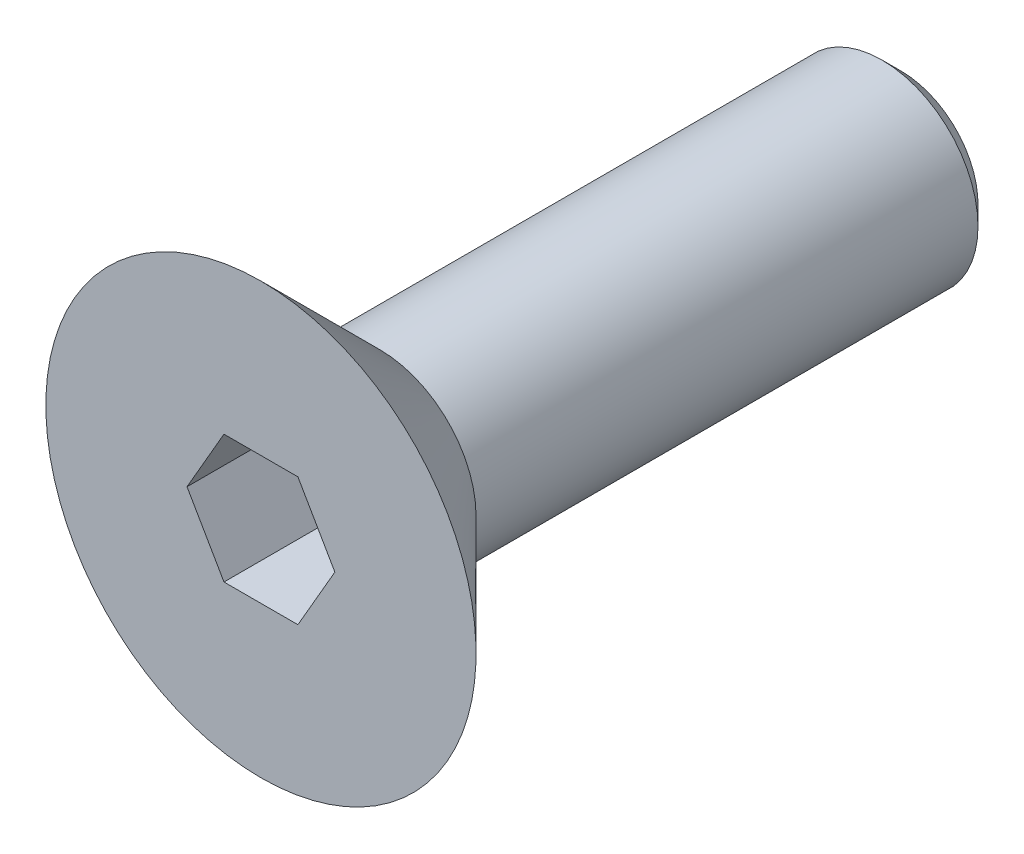
ISO-10303-21;
HEADER;
FILE_DESCRIPTION(('STEP AP214'),'2;1');
FILE_NAME('part.step','',(''),(''),'','','');
FILE_SCHEMA(('AUTOMOTIVE_DESIGN { 1 0 10303 214 1 1 1 1 }'));
ENDSEC;
DATA;
#1=APPLICATION_CONTEXT('core data for automotive mechanical design processes');
#2=APPLICATION_PROTOCOL_DEFINITION('international standard','automotive_design',2000,#1);
#3=PRODUCT_CONTEXT('',#1,'mechanical');
#4=PRODUCT('Part','Part','',(#3));
#5=PRODUCT_RELATED_PRODUCT_CATEGORY('part','',(#4));
#6=PRODUCT_DEFINITION_FORMATION('','',#4);
#7=PRODUCT_DEFINITION_CONTEXT('part definition',#1,'design');
#8=PRODUCT_DEFINITION('design','',#6,#7);
#9=PRODUCT_DEFINITION_SHAPE('','',#8);
#10=(LENGTH_UNIT() NAMED_UNIT(*) SI_UNIT(.MILLI.,.METRE.));
#11=(NAMED_UNIT(*) PLANE_ANGLE_UNIT() SI_UNIT($,.RADIAN.));
#12=(NAMED_UNIT(*) SI_UNIT($,.STERADIAN.) SOLID_ANGLE_UNIT());
#13=UNCERTAINTY_MEASURE_WITH_UNIT(LENGTH_MEASURE(1.E-05),#10,'distance_accuracy_value','');
#14=(GEOMETRIC_REPRESENTATION_CONTEXT(3) GLOBAL_UNCERTAINTY_ASSIGNED_CONTEXT((#13)) GLOBAL_UNIT_ASSIGNED_CONTEXT((#10,
#11,#12)) REPRESENTATION_CONTEXT('',''));
#15=CARTESIAN_POINT('',(0.,0.,0.));
#16=DIRECTION('',(0.,0.,1.));
#17=DIRECTION('',(1.,0.,0.));
#18=AXIS2_PLACEMENT_3D('',#15,#16,#17);
#19=CARTESIAN_POINT('',(0.,0.,0.));
#20=DIRECTION('',(0.,0.,1.));
#21=DIRECTION('',(0.,-1.,0.));
#22=AXIS2_PLACEMENT_3D('',#19,#20,#21);
#23=PLANE('',#22);
#24=DIRECTION('',(0.5,0.866025403784439,0.));
#25=VECTOR('',#24,1.);
#26=CARTESIAN_POINT('',(0.577350269189626,-1.,0.));
#27=LINE('',#26,#25);
#28=CARTESIAN_POINT('',(0.577350269189626,-1.,0.));
#29=VERTEX_POINT('',#28);
#30=CARTESIAN_POINT('',(1.15470053837925,0.,0.));
#31=VERTEX_POINT('',#30);
#32=EDGE_CURVE('E49',#29,#31,#27,.T.);
#33=ORIENTED_EDGE('',*,*,#32,.F.);
#34=DIRECTION('',(1.,0.,0.));
#35=VECTOR('',#34,1.);
#36=CARTESIAN_POINT('',(-0.577350269189626,-1.,0.));
#37=LINE('',#36,#35);
#38=CARTESIAN_POINT('',(-0.577350269189626,-1.,0.));
#39=VERTEX_POINT('',#38);
#40=EDGE_CURVE('E132',#39,#29,#37,.T.);
#41=ORIENTED_EDGE('',*,*,#40,.F.);
#42=DIRECTION('',(0.5,-0.866025403784438,0.));
#43=VECTOR('',#42,1.);
#44=CARTESIAN_POINT('',(-1.15470053837925,0.,0.));
#45=LINE('',#44,#43);
#46=CARTESIAN_POINT('',(-1.15470053837925,0.,0.));
#47=VERTEX_POINT('',#46);
#48=EDGE_CURVE('E130',#47,#39,#45,.T.);
#49=ORIENTED_EDGE('',*,*,#48,.F.);
#50=DIRECTION('',(-0.5,-0.866025403784439,0.));
#51=VECTOR('',#50,1.);
#52=CARTESIAN_POINT('',(-0.577350269189626,1.,0.));
#53=LINE('',#52,#51);
#54=CARTESIAN_POINT('',(-0.577350269189626,1.,0.));
#55=VERTEX_POINT('',#54);
#56=EDGE_CURVE('E97',#55,#47,#53,.T.);
#57=ORIENTED_EDGE('',*,*,#56,.F.);
#58=DIRECTION('',(-1.,0.,0.));
#59=VECTOR('',#58,1.);
#60=CARTESIAN_POINT('',(0.577350269189625,1.,0.));
#61=LINE('',#60,#59);
#62=CARTESIAN_POINT('',(0.577350269189625,1.,0.));
#63=VERTEX_POINT('',#62);
#64=EDGE_CURVE('E126',#63,#55,#61,.T.);
#65=ORIENTED_EDGE('',*,*,#64,.F.);
#66=DIRECTION('',(-0.5,0.866025403784438,0.));
#67=VECTOR('',#66,1.);
#68=CARTESIAN_POINT('',(1.15470053837925,0.,0.));
#69=LINE('',#68,#67);
#70=EDGE_CURVE('E123',#31,#63,#69,.T.);
#71=ORIENTED_EDGE('',*,*,#70,.F.);
#72=EDGE_LOOP('',(#33,#41,#49,#57,#65,#71));
#73=FACE_BOUND('',#72,.T.);
#74=CARTESIAN_POINT('',(0.,0.,0.));
#75=DIRECTION('',(0.,0.,-1.));
#76=DIRECTION('',(0.,1.,0.));
#77=AXIS2_PLACEMENT_3D('',#74,#75,#76);
#78=CIRCLE('',#77,3.36);
#79=CARTESIAN_POINT('',(0.,3.36,0.));
#80=VERTEX_POINT('',#79);
#81=EDGE_CURVE('E144',#80,#80,#78,.T.);
#82=ORIENTED_EDGE('',*,*,#81,.F.);
#83=EDGE_LOOP('',(#82));
#84=FACE_BOUND('',#83,.T.);
#85=ADVANCED_FACE('F34',(#73,#84),#23,.T.);
#86=CARTESIAN_POINT('',(0.,0.,-1.86));
#87=DIRECTION('',(0.,0.,1.));
#88=DIRECTION('',(0.,-1.,0.));
#89=AXIS2_PLACEMENT_3D('',#86,#87,#88);
#90=CONICAL_SURFACE('',#89,1.5,0.785398163397448);
#91=ORIENTED_EDGE('',*,*,#81,.T.);
#92=EDGE_LOOP('',(#91));
#93=FACE_BOUND('',#92,.T.);
#94=CARTESIAN_POINT('',(0.,0.,-1.86));
#95=DIRECTION('',(0.,0.,-1.));
#96=DIRECTION('',(0.,1.,0.));
#97=AXIS2_PLACEMENT_3D('',#94,#95,#96);
#98=CIRCLE('',#97,1.5);
#99=CARTESIAN_POINT('',(0.,1.5,-1.86));
#100=VERTEX_POINT('',#99);
#101=EDGE_CURVE('E136',#100,#100,#98,.T.);
#102=ORIENTED_EDGE('',*,*,#101,.F.);
#103=EDGE_LOOP('',(#102));
#104=FACE_BOUND('',#103,.T.);
#105=ADVANCED_FACE('F160',(#93,#104),#90,.T.);
#106=CARTESIAN_POINT('',(0.,0.,-10.));
#107=DIRECTION('',(0.,0.,-1.));
#108=DIRECTION('',(0.,1.,0.));
#109=AXIS2_PLACEMENT_3D('',#106,#107,#108);
#110=CYLINDRICAL_SURFACE('',#109,1.5);
#111=CARTESIAN_POINT('',(0.,0.,-9.7));
#112=DIRECTION('',(0.,0.,-1.));
#113=DIRECTION('',(0.,1.,0.));
#114=AXIS2_PLACEMENT_3D('',#111,#112,#113);
#115=CIRCLE('',#114,1.5);
#116=CARTESIAN_POINT('',(0.,1.5,-9.7));
#117=VERTEX_POINT('',#116);
#118=EDGE_CURVE('E11',#117,#117,#115,.F.);
#119=ORIENTED_EDGE('',*,*,#118,.T.);
#120=EDGE_LOOP('',(#119));
#121=FACE_BOUND('',#120,.T.);
#122=ORIENTED_EDGE('',*,*,#101,.T.);
#123=EDGE_LOOP('',(#122));
#124=FACE_BOUND('',#123,.T.);
#125=ADVANCED_FACE('F165',(#121,#124),#110,.T.);
#126=CARTESIAN_POINT('',(0.,1.5,-10.));
#127=DIRECTION('',(0.,0.,-1.));
#128=DIRECTION('',(0.,1.,0.));
#129=AXIS2_PLACEMENT_3D('',#126,#127,#128);
#130=PLANE('',#129);
#131=CARTESIAN_POINT('',(0.,0.,-10.));
#132=DIRECTION('',(0.,0.,-1.));
#133=DIRECTION('',(0.,1.,0.));
#134=AXIS2_PLACEMENT_3D('',#131,#132,#133);
#135=CIRCLE('',#134,1.2);
#136=CARTESIAN_POINT('',(0.,1.2,-10.));
#137=VERTEX_POINT('',#136);
#138=EDGE_CURVE('E42',#137,#137,#135,.T.);
#139=ORIENTED_EDGE('',*,*,#138,.T.);
#140=EDGE_LOOP('',(#139));
#141=FACE_BOUND('',#140,.T.);
#142=ADVANCED_FACE('F149',(#141),#130,.T.);
#143=CARTESIAN_POINT('',(0.577350269189626,-1.,-2.));
#144=DIRECTION('',(0.866025403784439,-0.5,0.));
#145=DIRECTION('',(0.5,0.866025403784439,0.));
#146=AXIS2_PLACEMENT_3D('',#143,#144,#145);
#147=PLANE('',#146);
#148=ORIENTED_EDGE('',*,*,#32,.T.);
#149=DIRECTION('',(0.,0.,1.));
#150=VECTOR('',#149,1.);
#151=CARTESIAN_POINT('',(1.15470053837925,0.,-2.));
#152=LINE('',#151,#150);
#153=CARTESIAN_POINT('',(1.15470053837925,0.,-2.));
#154=VERTEX_POINT('',#153);
#155=EDGE_CURVE('E79',#154,#31,#152,.T.);
#156=ORIENTED_EDGE('',*,*,#155,.F.);
#157=DIRECTION('',(0.5,0.866025403784439,0.));
#158=VECTOR('',#157,1.);
#159=CARTESIAN_POINT('',(0.577350269189626,-1.,-2.));
#160=LINE('',#159,#158);
#161=CARTESIAN_POINT('',(0.577350269189626,-1.,-2.));
#162=VERTEX_POINT('',#161);
#163=EDGE_CURVE('E134',#162,#154,#160,.T.);
#164=ORIENTED_EDGE('',*,*,#163,.F.);
#165=DIRECTION('',(0.,0.,1.));
#166=VECTOR('',#165,1.);
#167=CARTESIAN_POINT('',(0.577350269189626,-1.,-2.));
#168=LINE('',#167,#166);
#169=EDGE_CURVE('E57',#162,#29,#168,.T.);
#170=ORIENTED_EDGE('',*,*,#169,.T.);
#171=EDGE_LOOP('',(#148,#156,#164,#170));
#172=FACE_BOUND('',#171,.T.);
#173=ADVANCED_FACE('F175',(#172),#147,.F.);
#174=CARTESIAN_POINT('',(-0.577350269189626,-1.,-2.));
#175=DIRECTION('',(0.,-1.,0.));
#176=DIRECTION('',(1.,0.,0.));
#177=AXIS2_PLACEMENT_3D('',#174,#175,#176);
#178=PLANE('',#177);
#179=ORIENTED_EDGE('',*,*,#40,.T.);
#180=ORIENTED_EDGE('',*,*,#169,.F.);
#181=DIRECTION('',(1.,0.,0.));
#182=VECTOR('',#181,1.);
#183=CARTESIAN_POINT('',(-0.577350269189626,-1.,-2.));
#184=LINE('',#183,#182);
#185=CARTESIAN_POINT('',(-0.577350269189626,-1.,-2.));
#186=VERTEX_POINT('',#185);
#187=EDGE_CURVE('E109',#186,#162,#184,.T.);
#188=ORIENTED_EDGE('',*,*,#187,.F.);
#189=DIRECTION('',(0.,0.,1.));
#190=VECTOR('',#189,1.);
#191=CARTESIAN_POINT('',(-0.577350269189626,-1.,-2.));
#192=LINE('',#191,#190);
#193=EDGE_CURVE('E101',#186,#39,#192,.T.);
#194=ORIENTED_EDGE('',*,*,#193,.T.);
#195=EDGE_LOOP('',(#179,#180,#188,#194));
#196=FACE_BOUND('',#195,.T.);
#197=ADVANCED_FACE('F178',(#196),#178,.F.);
#198=CARTESIAN_POINT('',(-1.15470053837925,0.,-2.));
#199=DIRECTION('',(-0.866025403784438,-0.5,0.));
#200=DIRECTION('',(0.5,-0.866025403784438,0.));
#201=AXIS2_PLACEMENT_3D('',#198,#199,#200);
#202=PLANE('',#201);
#203=ORIENTED_EDGE('',*,*,#48,.T.);
#204=ORIENTED_EDGE('',*,*,#193,.F.);
#205=DIRECTION('',(0.5,-0.866025403784438,0.));
#206=VECTOR('',#205,1.);
#207=CARTESIAN_POINT('',(-1.15470053837925,0.,-2.));
#208=LINE('',#207,#206);
#209=CARTESIAN_POINT('',(-1.15470053837925,0.,-2.));
#210=VERTEX_POINT('',#209);
#211=EDGE_CURVE('E105',#210,#186,#208,.T.);
#212=ORIENTED_EDGE('',*,*,#211,.F.);
#213=DIRECTION('',(0.,0.,1.));
#214=VECTOR('',#213,1.);
#215=CARTESIAN_POINT('',(-1.15470053837925,0.,-2.));
#216=LINE('',#215,#214);
#217=EDGE_CURVE('E90',#210,#47,#216,.T.);
#218=ORIENTED_EDGE('',*,*,#217,.T.);
#219=EDGE_LOOP('',(#203,#204,#212,#218));
#220=FACE_BOUND('',#219,.T.);
#221=ADVANCED_FACE('F106',(#220),#202,.F.);
#222=CARTESIAN_POINT('',(-0.577350269189626,1.,-2.));
#223=DIRECTION('',(-0.866025403784439,0.5,0.));
#224=DIRECTION('',(-0.5,-0.866025403784439,0.));
#225=AXIS2_PLACEMENT_3D('',#222,#223,#224);
#226=PLANE('',#225);
#227=ORIENTED_EDGE('',*,*,#56,.T.);
#228=ORIENTED_EDGE('',*,*,#217,.F.);
#229=DIRECTION('',(-0.5,-0.866025403784439,0.));
#230=VECTOR('',#229,1.);
#231=CARTESIAN_POINT('',(-0.577350269189626,1.,-2.));
#232=LINE('',#231,#230);
#233=CARTESIAN_POINT('',(-0.577350269189626,1.,-2.));
#234=VERTEX_POINT('',#233);
#235=EDGE_CURVE('E94',#234,#210,#232,.T.);
#236=ORIENTED_EDGE('',*,*,#235,.F.);
#237=DIRECTION('',(0.,0.,1.));
#238=VECTOR('',#237,1.);
#239=CARTESIAN_POINT('',(-0.577350269189626,1.,-2.));
#240=LINE('',#239,#238);
#241=EDGE_CURVE('E102',#234,#55,#240,.T.);
#242=ORIENTED_EDGE('',*,*,#241,.T.);
#243=EDGE_LOOP('',(#227,#228,#236,#242));
#244=FACE_BOUND('',#243,.T.);
#245=ADVANCED_FACE('F92',(#244),#226,.F.);
#246=CARTESIAN_POINT('',(0.577350269189625,1.,-2.));
#247=DIRECTION('',(0.,1.,0.));
#248=DIRECTION('',(0.,0.,1.));
#249=AXIS2_PLACEMENT_3D('',#246,#247,#248);
#250=PLANE('',#249);
#251=ORIENTED_EDGE('',*,*,#64,.T.);
#252=ORIENTED_EDGE('',*,*,#241,.F.);
#253=DIRECTION('',(-1.,0.,0.));
#254=VECTOR('',#253,1.);
#255=CARTESIAN_POINT('',(0.577350269189625,1.,-2.));
#256=LINE('',#255,#254);
#257=CARTESIAN_POINT('',(0.577350269189625,1.,-2.));
#258=VERTEX_POINT('',#257);
#259=EDGE_CURVE('E115',#258,#234,#256,.T.);
#260=ORIENTED_EDGE('',*,*,#259,.F.);
#261=DIRECTION('',(0.,0.,1.));
#262=VECTOR('',#261,1.);
#263=CARTESIAN_POINT('',(0.577350269189625,1.,-2.));
#264=LINE('',#263,#262);
#265=EDGE_CURVE('E139',#258,#63,#264,.T.);
#266=ORIENTED_EDGE('',*,*,#265,.T.);
#267=EDGE_LOOP('',(#251,#252,#260,#266));
#268=FACE_BOUND('',#267,.T.);
#269=ADVANCED_FACE('F181',(#268),#250,.F.);
#270=CARTESIAN_POINT('',(1.15470053837925,0.,-2.));
#271=DIRECTION('',(0.866025403784439,0.5,0.));
#272=DIRECTION('',(-0.5,0.866025403784439,0.));
#273=AXIS2_PLACEMENT_3D('',#270,#271,#272);
#274=PLANE('',#273);
#275=ORIENTED_EDGE('',*,*,#70,.T.);
#276=ORIENTED_EDGE('',*,*,#265,.F.);
#277=DIRECTION('',(-0.5,0.866025403784438,0.));
#278=VECTOR('',#277,1.);
#279=CARTESIAN_POINT('',(1.15470053837925,0.,-2.));
#280=LINE('',#279,#278);
#281=EDGE_CURVE('E117',#154,#258,#280,.T.);
#282=ORIENTED_EDGE('',*,*,#281,.F.);
#283=ORIENTED_EDGE('',*,*,#155,.T.);
#284=EDGE_LOOP('',(#275,#276,#282,#283));
#285=FACE_BOUND('',#284,.T.);
#286=ADVANCED_FACE('F156',(#285),#274,.F.);
#287=CARTESIAN_POINT('',(0.,0.,-2.));
#288=DIRECTION('',(0.,0.,1.));
#289=DIRECTION('',(1.,0.,0.));
#290=AXIS2_PLACEMENT_3D('',#287,#288,#289);
#291=PLANE('',#290);
#292=ORIENTED_EDGE('',*,*,#163,.T.);
#293=ORIENTED_EDGE('',*,*,#281,.T.);
#294=ORIENTED_EDGE('',*,*,#259,.T.);
#295=ORIENTED_EDGE('',*,*,#235,.T.);
#296=ORIENTED_EDGE('',*,*,#211,.T.);
#297=ORIENTED_EDGE('',*,*,#187,.T.);
#298=EDGE_LOOP('',(#292,#293,#294,#295,#296,#297));
#299=FACE_BOUND('',#298,.T.);
#300=ADVANCED_FACE('F112',(#299),#291,.T.);
#301=CARTESIAN_POINT('',(0.,0.,-10.));
#302=DIRECTION('',(0.,0.,1.));
#303=DIRECTION('',(0.,-1.,0.));
#304=AXIS2_PLACEMENT_3D('',#301,#302,#303);
#305=CONICAL_SURFACE('',#304,1.2,0.785398163397443);
#306=ORIENTED_EDGE('',*,*,#118,.F.);
#307=EDGE_LOOP('',(#306));
#308=FACE_BOUND('',#307,.T.);
#309=ORIENTED_EDGE('',*,*,#138,.F.);
#310=EDGE_LOOP('',(#309));
#311=FACE_BOUND('',#310,.T.);
#312=ADVANCED_FACE('F36',(#308,#311),#305,.T.);
#313=CLOSED_SHELL('',(#85,#105,#125,#142,#173,#197,#221,#245,#269,#286,#300,#312));
#314=MANIFOLD_SOLID_BREP('B2',#313);
#315=ADVANCED_BREP_SHAPE_REPRESENTATION('',(#18,#314),#14);
#316=SHAPE_DEFINITION_REPRESENTATION(#9,#315);
ENDSEC;
END-ISO-10303-21;
